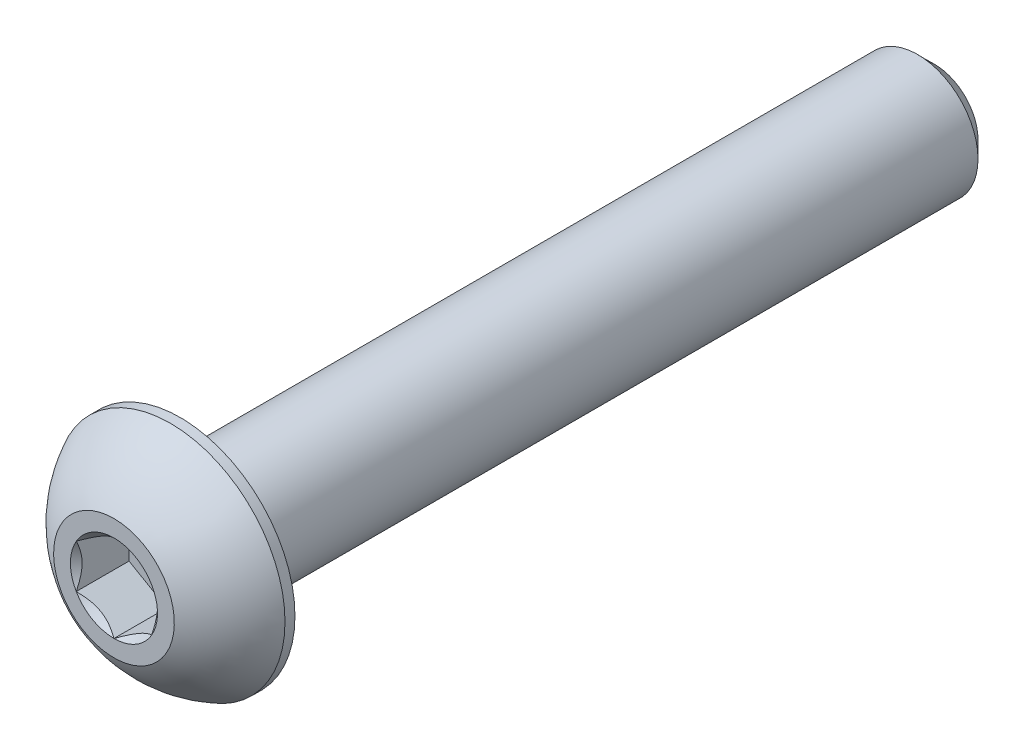
ISO-10303-21;
HEADER;
FILE_DESCRIPTION(('STEP AP214'),'2;1');
FILE_NAME('part.step','',(''),(''),'','','');
FILE_SCHEMA(('AUTOMOTIVE_DESIGN { 1 0 10303 214 1 1 1 1 }'));
ENDSEC;
DATA;
#1=APPLICATION_CONTEXT('core data for automotive mechanical design processes');
#2=APPLICATION_PROTOCOL_DEFINITION('international standard','automotive_design',2000,#1);
#3=PRODUCT_CONTEXT('',#1,'mechanical');
#4=PRODUCT('Part','Part','',(#3));
#5=PRODUCT_RELATED_PRODUCT_CATEGORY('part','',(#4));
#6=PRODUCT_DEFINITION_FORMATION('','',#4);
#7=PRODUCT_DEFINITION_CONTEXT('part definition',#1,'design');
#8=PRODUCT_DEFINITION('design','',#6,#7);
#9=PRODUCT_DEFINITION_SHAPE('','',#8);
#10=(LENGTH_UNIT() NAMED_UNIT(*) SI_UNIT(.MILLI.,.METRE.));
#11=(NAMED_UNIT(*) PLANE_ANGLE_UNIT() SI_UNIT($,.RADIAN.));
#12=(NAMED_UNIT(*) SI_UNIT($,.STERADIAN.) SOLID_ANGLE_UNIT());
#13=UNCERTAINTY_MEASURE_WITH_UNIT(LENGTH_MEASURE(1.E-05),#10,'distance_accuracy_value','');
#14=(GEOMETRIC_REPRESENTATION_CONTEXT(3) GLOBAL_UNCERTAINTY_ASSIGNED_CONTEXT((#13)) GLOBAL_UNIT_ASSIGNED_CONTEXT((#10,
#11,#12)) REPRESENTATION_CONTEXT('',''));
#15=CARTESIAN_POINT('',(0.,0.,0.));
#16=DIRECTION('',(0.,0.,1.));
#17=DIRECTION('',(1.,0.,0.));
#18=AXIS2_PLACEMENT_3D('',#15,#16,#17);
#19=CARTESIAN_POINT('',(0.,0.,13.6));
#20=DIRECTION('',(0.,0.,-1.));
#21=DIRECTION('',(-1.,0.,0.));
#22=AXIS2_PLACEMENT_3D('',#19,#20,#21);
#23=PLANE('',#22);
#24=CARTESIAN_POINT('',(0.,0.,13.6));
#25=DIRECTION('',(0.,0.,1.));
#26=DIRECTION('',(1.,0.,0.));
#27=AXIS2_PLACEMENT_3D('',#24,#25,#26);
#28=CIRCLE('',#27,1.44337567297406);
#29=CARTESIAN_POINT('',(-1.25,0.721687836487033,13.6));
#30=VERTEX_POINT('',#29);
#31=CARTESIAN_POINT('',(-1.25,-0.721687836487033,13.6));
#32=VERTEX_POINT('',#31);
#33=EDGE_CURVE('E130',#30,#32,#28,.T.);
#34=ORIENTED_EDGE('',*,*,#33,.F.);
#35=CARTESIAN_POINT('',(0.,1.44337567297406,13.6));
#36=VERTEX_POINT('',#35);
#37=EDGE_CURVE('E102',#36,#30,#28,.T.);
#38=ORIENTED_EDGE('',*,*,#37,.F.);
#39=CARTESIAN_POINT('',(1.25,0.721687836487032,13.6));
#40=VERTEX_POINT('',#39);
#41=EDGE_CURVE('E93',#40,#36,#28,.T.);
#42=ORIENTED_EDGE('',*,*,#41,.F.);
#43=CARTESIAN_POINT('',(1.25,-0.721687836487032,13.6));
#44=VERTEX_POINT('',#43);
#45=EDGE_CURVE('E54',#44,#40,#28,.T.);
#46=ORIENTED_EDGE('',*,*,#45,.F.);
#47=CARTESIAN_POINT('',(0.,-1.44337567297406,13.6));
#48=VERTEX_POINT('',#47);
#49=EDGE_CURVE('E61',#48,#44,#28,.T.);
#50=ORIENTED_EDGE('',*,*,#49,.F.);
#51=EDGE_CURVE('E131',#32,#48,#28,.T.);
#52=ORIENTED_EDGE('',*,*,#51,.F.);
#53=EDGE_LOOP('',(#34,#38,#42,#46,#50,#52));
#54=FACE_BOUND('',#53,.T.);
#55=CARTESIAN_POINT('',(0.,0.,13.6));
#56=DIRECTION('',(0.,0.,1.));
#57=DIRECTION('',(1.,0.,0.));
#58=AXIS2_PLACEMENT_3D('',#55,#56,#57);
#59=CIRCLE('',#58,2.);
#60=CARTESIAN_POINT('',(0.,2.,13.6));
#61=VERTEX_POINT('',#60);
#62=EDGE_CURVE('E48',#61,#61,#59,.T.);
#63=ORIENTED_EDGE('',*,*,#62,.T.);
#64=EDGE_LOOP('',(#63));
#65=FACE_BOUND('',#64,.T.);
#66=ADVANCED_FACE('F35',(#54,#65),#23,.F.);
#67=CARTESIAN_POINT('',(0.,0.,9.87355614973262));
#68=DIRECTION('',(0.,0.,1.));
#69=DIRECTION('',(0.,1.,0.));
#70=AXIS2_PLACEMENT_3D('',#67,#68,#69);
#71=SPHERICAL_SURFACE('',#70,4.22922968981298);
#72=CARTESIAN_POINT('',(0.,0.,11.73));
#73=DIRECTION('',(0.,0.,1.));
#74=DIRECTION('',(1.,0.,0.));
#75=AXIS2_PLACEMENT_3D('',#72,#73,#74);
#76=CIRCLE('',#75,3.8);
#77=CARTESIAN_POINT('',(0.,3.8,11.73));
#78=VERTEX_POINT('',#77);
#79=EDGE_CURVE('E213',#78,#78,#76,.T.);
#80=CARTESIAN_POINT('',(0.,2.,13.6));
#81=CARTESIAN_POINT('',(0.,2.02421343985614,13.5870045740355));
#82=CARTESIAN_POINT('',(0.,2.04830018323974,13.5737730870349));
#83=CARTESIAN_POINT('',(0.,2.09621120342126,13.5468431584943));
#84=CARTESIAN_POINT('',(0.,2.12003548021917,13.5331447169543));
#85=CARTESIAN_POINT('',(0.,2.16741249358867,13.505286046868));
#86=CARTESIAN_POINT('',(0.,2.19096523016026,13.4911258183216));
#87=CARTESIAN_POINT('',(0.,2.23779021933682,13.462348964764));
#88=CARTESIAN_POINT('',(0.,2.26106247194181,13.4477323397528));
#89=CARTESIAN_POINT('',(0.,2.30731764886072,13.4180482444859));
#90=CARTESIAN_POINT('',(0.,2.33030057317465,13.4029807742302));
#91=CARTESIAN_POINT('',(0.,2.37596836104235,13.3724007144171));
#92=CARTESIAN_POINT('',(0.,2.39865322459612,13.3568881248597));
#93=CARTESIAN_POINT('',(0.,2.44371627121513,13.3254237206041));
#94=CARTESIAN_POINT('',(0.,2.46609445428038,13.3094719059059));
#95=CARTESIAN_POINT('',(0.,2.51053563686181,13.2771351126683));
#96=CARTESIAN_POINT('',(0.,2.53259863637801,13.2607501341289));
#97=CARTESIAN_POINT('',(0.,2.57640106852492,13.2275532390328));
#98=CARTESIAN_POINT('',(0.,2.59814050115564,13.2107413224761));
#99=CARTESIAN_POINT('',(0.,2.64128753915153,13.1766969394119));
#100=CARTESIAN_POINT('',(0.,2.66269514451671,13.1594644729043));
#101=CARTESIAN_POINT('',(0.,2.70517039368395,13.124585537797));
#102=CARTESIAN_POINT('',(0.,2.72623803748602,13.1069390691974));
#103=CARTESIAN_POINT('',(0.,2.76802535840618,13.0712388350756));
#104=CARTESIAN_POINT('',(0.,2.78874503552428,13.0531850695534));
#105=CARTESIAN_POINT('',(0.,2.82982855017313,13.0166771015172));
#106=CARTESIAN_POINT('',(0.,2.85019238770389,12.9982228990032));
#107=CARTESIAN_POINT('',(0.,2.89055648548394,12.960921069069));
#108=CARTESIAN_POINT('',(0.,2.91055674573324,12.9420734416488));
#109=CARTESIAN_POINT('',(0.,2.95018608940553,12.9039919234787));
#110=CARTESIAN_POINT('',(0.,2.96981517282852,12.8847580327288));
#111=CARTESIAN_POINT('',(0.,3.00869470434027,12.8459112962447));
#112=CARTESIAN_POINT('',(0.,3.02794515242903,12.8262984505106));
#113=CARTESIAN_POINT('',(0.,3.06606009863533,12.7867012563963));
#114=CARTESIAN_POINT('',(0.,3.08492459675287,12.7667169080161));
#115=CARTESIAN_POINT('',(0.,3.12226047503002,12.7263843021083));
#116=CARTESIAN_POINT('',(0.,3.14073185518965,12.7060360445808));
#117=CARTESIAN_POINT('',(0.,3.17727447893821,12.6649833521526));
#118=CARTESIAN_POINT('',(0.,3.19534572252715,12.6442789172519));
#119=CARTESIAN_POINT('',(0.,3.23108120656242,12.602521737189));
#120=CARTESIAN_POINT('',(0.,3.24874544700875,12.5814689920269));
#121=CARTESIAN_POINT('',(0.,3.28366021283673,12.539023190901));
#122=CARTESIAN_POINT('',(0.,3.30091073821839,12.5176301349374));
#123=CARTESIAN_POINT('',(0.,3.33499151919534,12.4745118409772));
#124=CARTESIAN_POINT('',(0.,3.35182177479064,12.4527866029806));
#125=CARTESIAN_POINT('',(0.,3.38505562116371,12.4090121999432));
#126=CARTESIAN_POINT('',(0.,3.40145921194149,12.3869630349023));
#127=CARTESIAN_POINT('',(0.,3.43383349577047,12.3425491558485));
#128=CARTESIAN_POINT('',(0.,3.44980418882166,12.3201844418356));
#129=CARTESIAN_POINT('',(0.,3.48130660877275,12.2751479628077));
#130=CARTESIAN_POINT('',(0.,3.49683833567264,12.2524761977926));
#131=CARTESIAN_POINT('',(0.,3.52745692170931,12.2068342314103));
#132=CARTESIAN_POINT('',(0.,3.5425437808461,12.1838640300431));
#133=CARTESIAN_POINT('',(0.,3.57226689871518,12.1376339189693));
#134=CARTESIAN_POINT('',(0.,3.58690315744748,12.1143740092629));
#135=CARTESIAN_POINT('',(0.,3.61571951333199,12.0675733197334));
#136=CARTESIAN_POINT('',(0.,3.62989961048422,12.0440325399103));
#137=CARTESIAN_POINT('',(0.,3.65779825442823,11.9966790546141));
#138=CARTESIAN_POINT('',(0.,3.67151680122002,11.9728663491409));
#139=CARTESIAN_POINT('',(0.,3.69848713452322,11.9249780621223));
#140=CARTESIAN_POINT('',(0.,3.71173892103462,11.9009024805769));
#141=CARTESIAN_POINT('',(0.,3.73777068821038,11.8524975842079));
#142=CARTESIAN_POINT('',(0.,3.75055066887474,11.8281682693842));
#143=CARTESIAN_POINT('',(0.,3.77563400658954,11.7792651705548));
#144=CARTESIAN_POINT('',(0.,3.78793736363997,11.754691386549));
#145=CARTESIAN_POINT('',(0.,3.8,11.73));
#146=B_SPLINE_CURVE_WITH_KNOTS('',3,(#80,#81,#82,#83,#84,#85,#86,#87,#88,#89,#90,#91,#92,#93,
#94,#95,#96,#97,#98,#99,#100,#101,#102,#103,#104,#105,#106,#107,#108,#109,#110,#111,#112,#113,
#114,#115,#116,#117,#118,#119,#120,#121,#122,#123,#124,#125,#126,#127,#128,#129,#130,#131,#132,
#133,#134,#135,#136,#137,#138,#139,#140,#141,#142,#143,#144,#145),.UNSPECIFIED.,.F.,.F.,(4,2,2,
2,2,2,2,2,2,2,2,2,2,2,2,2,2,2,2,2,2,2,2,2,2,2,2,2,2,2,2,2,4),(0.,0.0824398589102646,
0.164879717820529,0.247319576730793,0.329759435641058,0.412199294551322,0.494639153461586,
0.577079012371851,0.659518871282115,0.74195873019238,0.824398589102644,0.906838448012908,
0.989278306923172,1.07171816583344,1.1541580247437,1.23659788365397,1.31903774256423,
1.40147760147449,1.48391746038476,1.56635731929502,1.64879717820529,1.73123703711555,
1.81367689602582,1.89611675493608,1.97855661384635,2.06099647275661,2.14343633166687,
2.22587619057714,2.3083160494874,2.39075590839767,2.47319576730793,2.55563562621819,
2.63807548512846),.UNSPECIFIED.);
#147=EDGE_CURVE('BSEAM218',#61,#78,#146,.T.);
#148=ORIENTED_EDGE('',*,*,#62,.F.);
#149=ORIENTED_EDGE('',*,*,#79,.T.);
#150=ORIENTED_EDGE('',*,*,#147,.T.);
#151=ORIENTED_EDGE('',*,*,#147,.F.);
#152=EDGE_LOOP('',(#148,#150,#149,#151));
#153=FACE_BOUND('',#152,.T.);
#154=ADVANCED_FACE('F218',(#153),#71,.T.);
#155=CARTESIAN_POINT('',(0.,0.,13.6));
#156=DIRECTION('',(0.,0.,1.));
#157=DIRECTION('',(1.,0.,0.));
#158=AXIS2_PLACEMENT_3D('',#155,#156,#157);
#159=CYLINDRICAL_SURFACE('',#158,3.8);
#160=ORIENTED_EDGE('',*,*,#79,.F.);
#161=EDGE_LOOP('',(#160));
#162=FACE_BOUND('',#161,.T.);
#163=CARTESIAN_POINT('',(0.,0.,11.4));
#164=DIRECTION('',(0.,0.,1.));
#165=DIRECTION('',(1.,0.,0.));
#166=AXIS2_PLACEMENT_3D('',#163,#164,#165);
#167=CIRCLE('',#166,3.8);
#168=CARTESIAN_POINT('',(3.8,0.,11.4));
#169=VERTEX_POINT('',#168);
#170=EDGE_CURVE('E210',#169,#169,#167,.T.);
#171=ORIENTED_EDGE('',*,*,#170,.T.);
#172=EDGE_LOOP('',(#171));
#173=FACE_BOUND('',#172,.T.);
#174=ADVANCED_FACE('F221',(#162,#173),#159,.T.);
#175=CARTESIAN_POINT('',(0.,1.99999999999999,11.4));
#176=DIRECTION('',(0.,0.,1.));
#177=DIRECTION('',(1.,0.,0.));
#178=AXIS2_PLACEMENT_3D('',#175,#176,#177);
#179=PLANE('',#178);
#180=ORIENTED_EDGE('',*,*,#170,.F.);
#181=EDGE_LOOP('',(#180));
#182=FACE_BOUND('',#181,.T.);
#183=CARTESIAN_POINT('',(0.,0.,11.4));
#184=DIRECTION('',(0.,0.,1.));
#185=DIRECTION('',(1.,0.,0.));
#186=AXIS2_PLACEMENT_3D('',#183,#184,#185);
#187=CIRCLE('',#186,1.99999999999999);
#188=CARTESIAN_POINT('',(1.99999999999999,0.,11.4));
#189=VERTEX_POINT('',#188);
#190=EDGE_CURVE('E207',#189,#189,#187,.T.);
#191=ORIENTED_EDGE('',*,*,#190,.T.);
#192=EDGE_LOOP('',(#191));
#193=FACE_BOUND('',#192,.T.);
#194=ADVANCED_FACE('F226',(#182,#193),#179,.F.);
#195=CARTESIAN_POINT('',(0.,0.,13.6));
#196=DIRECTION('',(0.,0.,1.));
#197=DIRECTION('',(1.,0.,0.));
#198=AXIS2_PLACEMENT_3D('',#195,#196,#197);
#199=CYLINDRICAL_SURFACE('',#198,1.99999999999999);
#200=ORIENTED_EDGE('',*,*,#190,.F.);
#201=EDGE_LOOP('',(#200));
#202=FACE_BOUND('',#201,.T.);
#203=CARTESIAN_POINT('',(0.,0.,-13.04));
#204=DIRECTION('',(0.,0.,1.));
#205=DIRECTION('',(1.,0.,0.));
#206=AXIS2_PLACEMENT_3D('',#203,#204,#205);
#207=CIRCLE('',#206,1.99999999999999);
#208=CARTESIAN_POINT('',(1.99999999999999,0.,-13.04));
#209=VERTEX_POINT('',#208);
#210=EDGE_CURVE('E204',#209,#209,#207,.T.);
#211=ORIENTED_EDGE('',*,*,#210,.T.);
#212=EDGE_LOOP('',(#211));
#213=FACE_BOUND('',#212,.T.);
#214=ADVANCED_FACE('F232',(#202,#213),#199,.T.);
#215=CARTESIAN_POINT('',(0.,0.,-13.6));
#216=DIRECTION('',(0.,0.,1.));
#217=DIRECTION('',(1.,0.,0.));
#218=AXIS2_PLACEMENT_3D('',#215,#216,#217);
#219=CONICAL_SURFACE('',#218,1.44,0.785398163397446);
#220=ORIENTED_EDGE('',*,*,#210,.F.);
#221=EDGE_LOOP('',(#220));
#222=FACE_BOUND('',#221,.T.);
#223=CARTESIAN_POINT('',(0.,0.,-13.6));
#224=DIRECTION('',(0.,0.,1.));
#225=DIRECTION('',(1.,0.,0.));
#226=AXIS2_PLACEMENT_3D('',#223,#224,#225);
#227=CIRCLE('',#226,1.44);
#228=CARTESIAN_POINT('',(1.44,0.,-13.6));
#229=VERTEX_POINT('',#228);
#230=EDGE_CURVE('E191',#229,#229,#227,.T.);
#231=ORIENTED_EDGE('',*,*,#230,.T.);
#232=EDGE_LOOP('',(#231));
#233=FACE_BOUND('',#232,.T.);
#234=ADVANCED_FACE('F238',(#222,#233),#219,.T.);
#235=CARTESIAN_POINT('',(0.,0.,-13.6));
#236=DIRECTION('',(0.,0.,1.));
#237=DIRECTION('',(1.,0.,0.));
#238=AXIS2_PLACEMENT_3D('',#235,#236,#237);
#239=PLANE('',#238);
#240=ORIENTED_EDGE('',*,*,#230,.F.);
#241=EDGE_LOOP('',(#240));
#242=FACE_BOUND('',#241,.T.);
#243=ADVANCED_FACE('F164',(#242),#239,.F.);
#244=CARTESIAN_POINT('',(0.,0.,13.6));
#245=DIRECTION('',(0.,0.,1.));
#246=DIRECTION('',(1.,0.,0.));
#247=AXIS2_PLACEMENT_3D('',#244,#245,#246);
#248=CONICAL_SURFACE('',#247,1.44337567297406,0.78539816339745);
#249=ORIENTED_EDGE('',*,*,#37,.T.);
#250=CARTESIAN_POINT('',(0.000199999999999687,1.4434911430279,13.6001154839091));
#251=CARTESIAN_POINT('',(-0.0427751670715871,1.41867941875065,13.5753216680551));
#252=CARTESIAN_POINT('',(-0.0864690047459485,1.39345276980743,13.5519837344187));
#253=CARTESIAN_POINT('',(-0.175565930841942,1.34201263554194,13.5092520040845));
#254=CARTESIAN_POINT('',(-0.220977498357064,1.31579425481276,13.4898819923604));
#255=CARTESIAN_POINT('',(-0.31254782093526,1.26292610442246,13.4567004834135));
#256=CARTESIAN_POINT('',(-0.358683240175886,1.23628980770471,13.4428055590527));
#257=CARTESIAN_POINT('',(-0.451970080407593,1.18243062538508,13.4213972821606));
#258=CARTESIAN_POINT('',(-0.49911864913638,1.15520938653761,13.4138679415668));
#259=CARTESIAN_POINT('',(-0.580373556887252,1.10829684367467,13.4070744980507));
#260=CARTESIAN_POINT('',(-0.614374876627941,1.08866617256958,13.4060685591043));
#261=CARTESIAN_POINT('',(-0.682317764432477,1.04943932800611,13.4077614149113));
#262=CARTESIAN_POINT('',(-0.716259317655657,1.02984316311599,13.4104610272155));
#263=CARTESIAN_POINT('',(-0.783814856457499,0.9908399546035,13.4194089303164));
#264=CARTESIAN_POINT('',(-0.817428507286775,0.971433104248771,13.4256605258997));
#265=CARTESIAN_POINT('',(-0.884094638217813,0.932943395609906,13.4413756814139));
#266=CARTESIAN_POINT('',(-0.917146871030295,0.913860680098301,13.4508406200875));
#267=CARTESIAN_POINT('',(-1.00179969160026,0.864986351354568,13.4789313906876));
#268=CARTESIAN_POINT('',(-1.05286649242964,0.835502920149076,13.4996701574522));
#269=CARTESIAN_POINT('',(-1.15300085411325,0.777690319475909,13.5463871346715));
#270=CARTESIAN_POINT('',(-1.20207431157827,0.749357745598417,13.5723482959468));
#271=CARTESIAN_POINT('',(-1.2502,0.721572366433195,13.6001154839091));
#272=B_SPLINE_CURVE_WITH_KNOTS('',3,(#250,#251,#252,#253,#254,#255,#256,#257,#258,#259,#260,
#261,#262,#263,#264,#265,#266,#267,#268,#269,#270,#271),.UNSPECIFIED.,.F.,.F.,(4,2,2,2,2,2,2,2,
2,2,4),(0.,0.166533409618304,0.334037607289761,0.498880396489697,0.663307919240274,
0.780963963458826,0.898645970148452,1.01643764860773,1.13427993171549,1.32148652032141,
1.50809158792573),.UNSPECIFIED.);
#273=EDGE_CURVE('E11',#36,#30,#272,.T.);
#274=ORIENTED_EDGE('',*,*,#273,.F.);
#275=EDGE_LOOP('',(#249,#274));
#276=FACE_BOUND('',#275,.T.);
#277=ADVANCED_FACE('F106',(#276),#248,.F.);
#278=ORIENTED_EDGE('',*,*,#33,.T.);
#279=CARTESIAN_POINT('',(-1.25,-1.43934010808077,14.0629820968923));
#280=CARTESIAN_POINT('',(-1.25,-1.40429313005659,14.0365249226329));
#281=CARTESIAN_POINT('',(-1.25,-1.36905087135599,14.0103271603543));
#282=CARTESIAN_POINT('',(-1.25,-1.29809650706311,13.9585575718396));
#283=CARTESIAN_POINT('',(-1.25,-1.26238428576495,13.9329859043563));
#284=CARTESIAN_POINT('',(-1.25,-1.15390111792708,13.8570059936895));
#285=CARTESIAN_POINT('',(-1.25,-1.08031646726264,13.8077402861896));
#286=CARTESIAN_POINT('',(-1.25,-0.926012322755095,13.7110258302631));
#287=CARTESIAN_POINT('',(-1.25,-0.845125318656146,13.6638412989418));
#288=CARTESIAN_POINT('',(-1.25,-0.679311174076602,13.5775307343904));
#289=CARTESIAN_POINT('',(-1.25,-0.594398891026688,13.5383775346269));
#290=CARTESIAN_POINT('',(-1.25,-0.46694481246074,13.4904772236883));
#291=CARTESIAN_POINT('',(-1.25,-0.426289985812821,13.4767294897863));
#292=CARTESIAN_POINT('',(-1.25,-0.343998850091267,13.4524979274505));
#293=CARTESIAN_POINT('',(-1.25,-0.302362473614962,13.4420143238698));
#294=CARTESIAN_POINT('',(-1.25,-0.219052696285666,13.4250301617483));
#295=CARTESIAN_POINT('',(-1.25,-0.1773934284745,13.4184613604714));
#296=CARTESIAN_POINT('',(-1.25,-0.0936293693401925,13.4094350534578));
#297=CARTESIAN_POINT('',(-1.25,-0.0515246558543965,13.4069768409973));
#298=CARTESIAN_POINT('',(-1.25,0.0311890576306309,13.4063540620133));
#299=CARTESIAN_POINT('',(-1.25,0.0717969625499298,13.4080371168462));
#300=CARTESIAN_POINT('',(-1.25,0.152668636885196,13.4152682705979));
#301=CARTESIAN_POINT('',(-1.25,0.192932338835357,13.4208171104131));
#302=CARTESIAN_POINT('',(-1.25,0.273499879165294,13.435571036465));
#303=CARTESIAN_POINT('',(-1.25,0.31379218061851,13.4448381759641));
#304=CARTESIAN_POINT('',(-1.25,0.393496413911456,13.4665361784573));
#305=CARTESIAN_POINT('',(-1.25,0.432908419115058,13.4789667767306));
#306=CARTESIAN_POINT('',(-1.25,0.556992735862297,13.5227793529314));
#307=CARTESIAN_POINT('',(-1.25,0.639898924666084,13.559151072876));
#308=CARTESIAN_POINT('',(-1.25,0.8018165554997,13.6400191621783));
#309=CARTESIAN_POINT('',(-1.25,0.880812666325043,13.684544720912));
#310=CARTESIAN_POINT('',(-1.25,1.0317856127975,13.7764048766666));
#311=CARTESIAN_POINT('',(-1.25,1.10391618485086,13.8234899339162));
#312=CARTESIAN_POINT('',(-1.25,1.2101860604331,13.8962785615985));
#313=CARTESIAN_POINT('',(-1.25,1.24515069969379,13.9207980853934));
#314=CARTESIAN_POINT('',(-1.25,1.31460220852736,13.9704856367657));
#315=CARTESIAN_POINT('',(-1.25,1.34908920596618,13.9956534854155));
#316=CARTESIAN_POINT('',(-1.25,1.38337731682911,14.0210901488412));
#317=B_SPLINE_CURVE_WITH_KNOTS('',3,(#279,#280,#281,#282,#283,#284,#285,#286,#287,#288,#289,
#290,#291,#292,#293,#294,#295,#296,#297,#298,#299,#300,#301,#302,#303,#304,#305,#306,#307,#308,
#309,#310,#311,#312,#313,#314,#315,#316),.UNSPECIFIED.,.F.,.F.,(4,2,2,2,2,2,2,2,2,2,2,2,2,2,2,2,
2,2,4),(0.,0.131732960381448,0.263498984161645,0.529042014455826,0.80974192613462,
1.08947609717225,1.21811634272577,1.346765447839,1.47310084517844,1.59941451973784,
1.72115042167849,1.84290966131735,1.96679153905342,2.09066305366039,2.36146692896009,
2.63325989198491,2.89154668212279,3.01965734507713,3.14773302245628),.UNSPECIFIED.);
#318=EDGE_CURVE('E101',#30,#32,#317,.F.);
#319=ORIENTED_EDGE('',*,*,#318,.F.);
#320=EDGE_LOOP('',(#278,#319));
#321=FACE_BOUND('',#320,.T.);
#322=ADVANCED_FACE('F251',(#321),#248,.F.);
#323=ORIENTED_EDGE('',*,*,#51,.T.);
#324=CARTESIAN_POINT('',(-1.2502,-0.721572366433194,13.6001154839091));
#325=CARTESIAN_POINT('',(-1.20722483292841,-0.746384090710444,13.5753216680551));
#326=CARTESIAN_POINT('',(-1.16353099525405,-0.771610739653665,13.5519837344187));
#327=CARTESIAN_POINT('',(-1.07443406915806,-0.823050873919155,13.5092520040845));
#328=CARTESIAN_POINT('',(-1.02902250164294,-0.849269254648334,13.4898819923604));
#329=CARTESIAN_POINT('',(-0.937452179064739,-0.902137405038636,13.4567004834135));
#330=CARTESIAN_POINT('',(-0.891316759824113,-0.928773701756388,13.4428055590527));
#331=CARTESIAN_POINT('',(-0.798029919592406,-0.982632884076013,13.4213972821606));
#332=CARTESIAN_POINT('',(-0.750881350863619,-1.00985412292348,13.4138679415668));
#333=CARTESIAN_POINT('',(-0.669626443112747,-1.05676666578643,13.4070744980507));
#334=CARTESIAN_POINT('',(-0.635625123372058,-1.07639733689152,13.4060685591043));
#335=CARTESIAN_POINT('',(-0.567682235567522,-1.11562418145499,13.4077614149113));
#336=CARTESIAN_POINT('',(-0.533740682344342,-1.1352203463451,13.4104610272155));
#337=CARTESIAN_POINT('',(-0.4661851435425,-1.1742235548576,13.4194089303164));
#338=CARTESIAN_POINT('',(-0.432571492713225,-1.19363040521233,13.4256605258997));
#339=CARTESIAN_POINT('',(-0.365905361782186,-1.23212011385119,13.4413756814139));
#340=CARTESIAN_POINT('',(-0.332853128969704,-1.2512028293628,13.4508406200875));
#341=CARTESIAN_POINT('',(-0.248200308399735,-1.30007715810653,13.4789313906876));
#342=CARTESIAN_POINT('',(-0.197133507570362,-1.32956058931202,13.4996701574522));
#343=CARTESIAN_POINT('',(-0.0969991458867455,-1.38737318998519,13.5463871346715));
#344=CARTESIAN_POINT('',(-0.047925688421731,-1.41570576386268,13.5723482959468));
#345=CARTESIAN_POINT('',(0.000199999999999445,-1.4434911430279,13.6001154839091));
#346=B_SPLINE_CURVE_WITH_KNOTS('',3,(#324,#325,#326,#327,#328,#329,#330,#331,#332,#333,#334,
#335,#336,#337,#338,#339,#340,#341,#342,#343,#344,#345),.UNSPECIFIED.,.F.,.F.,(4,2,2,2,2,2,2,2,
2,2,4),(0.,0.166533409618305,0.334037607289762,0.498880396489699,0.663307919240275,
0.780963963458827,0.898645970148453,1.01643764860773,1.1342799317155,1.32148652032141,
1.50809158792573),.UNSPECIFIED.);
#347=EDGE_CURVE('E140',#32,#48,#346,.T.);
#348=ORIENTED_EDGE('',*,*,#347,.F.);
#349=EDGE_LOOP('',(#323,#348));
#350=FACE_BOUND('',#349,.T.);
#351=ADVANCED_FACE('F268',(#350),#248,.F.);
#352=ORIENTED_EDGE('',*,*,#49,.T.);
#353=CARTESIAN_POINT('',(-0.000200000000000272,-1.4434911430279,13.6001154839091));
#354=CARTESIAN_POINT('',(0.0427751670715867,-1.41867941875065,13.5753216680551));
#355=CARTESIAN_POINT('',(0.0864690047459484,-1.39345276980743,13.5519837344187));
#356=CARTESIAN_POINT('',(0.175565930841943,-1.34201263554194,13.5092520040845));
#357=CARTESIAN_POINT('',(0.220977498357065,-1.31579425481276,13.4898819923604));
#358=CARTESIAN_POINT('',(0.31254782093526,-1.26292610442246,13.4567004834135));
#359=CARTESIAN_POINT('',(0.358683240175886,-1.23628980770471,13.4428055590527));
#360=CARTESIAN_POINT('',(0.451970080407593,-1.18243062538508,13.4213972821606));
#361=CARTESIAN_POINT('',(0.499118649136381,-1.15520938653761,13.4138679415668));
#362=CARTESIAN_POINT('',(0.580373556887253,-1.10829684367467,13.4070744980507));
#363=CARTESIAN_POINT('',(0.614374876627942,-1.08866617256958,13.4060685591043));
#364=CARTESIAN_POINT('',(0.682317764432478,-1.04943932800611,13.4077614149113));
#365=CARTESIAN_POINT('',(0.716259317655658,-1.02984316311599,13.4104610272155));
#366=CARTESIAN_POINT('',(0.7838148564575,-0.990839954603498,13.4194089303164));
#367=CARTESIAN_POINT('',(0.817428507286776,-0.97143310424877,13.4256605258997));
#368=CARTESIAN_POINT('',(0.884094638217814,-0.932943395609904,13.4413756814139));
#369=CARTESIAN_POINT('',(0.917146871030297,-0.9138606800983,13.4508406200875));
#370=CARTESIAN_POINT('',(1.00179969160027,-0.864986351354567,13.4789313906876));
#371=CARTESIAN_POINT('',(1.05286649242964,-0.835502920149075,13.4996701574522));
#372=CARTESIAN_POINT('',(1.15300085411325,-0.777690319475908,13.5463871346715));
#373=CARTESIAN_POINT('',(1.20207431157827,-0.749357745598417,13.5723482959468));
#374=CARTESIAN_POINT('',(1.2502,-0.721572366433194,13.6001154839091));
#375=B_SPLINE_CURVE_WITH_KNOTS('',3,(#353,#354,#355,#356,#357,#358,#359,#360,#361,#362,#363,
#364,#365,#366,#367,#368,#369,#370,#371,#372,#373,#374),.UNSPECIFIED.,.F.,.F.,(4,2,2,2,2,2,2,2,
2,2,4),(0.,0.166533409618305,0.334037607289762,0.498880396489699,0.663307919240275,
0.780963963458828,0.898645970148454,1.01643764860773,1.1342799317155,1.32148652032141,
1.50809158792574),.UNSPECIFIED.);
#376=EDGE_CURVE('E348',#48,#44,#375,.T.);
#377=ORIENTED_EDGE('',*,*,#376,.F.);
#378=EDGE_LOOP('',(#352,#377));
#379=FACE_BOUND('',#378,.T.);
#380=ADVANCED_FACE('F275',(#379),#248,.F.);
#381=ORIENTED_EDGE('',*,*,#45,.T.);
#382=CARTESIAN_POINT('',(1.25,-1.43934010808077,14.0629820968923));
#383=CARTESIAN_POINT('',(1.25,-1.40429313005659,14.0365249226329));
#384=CARTESIAN_POINT('',(1.25,-1.36905087135599,14.0103271603543));
#385=CARTESIAN_POINT('',(1.25,-1.29809650706311,13.9585575718396));
#386=CARTESIAN_POINT('',(1.25,-1.26238428576495,13.9329859043563));
#387=CARTESIAN_POINT('',(1.25,-1.15390111792708,13.8570059936895));
#388=CARTESIAN_POINT('',(1.25,-1.08031646726264,13.8077402861896));
#389=CARTESIAN_POINT('',(1.25,-0.926012322755094,13.7110258302631));
#390=CARTESIAN_POINT('',(1.25,-0.845125318656145,13.6638412989418));
#391=CARTESIAN_POINT('',(1.25,-0.679311174076601,13.5775307343904));
#392=CARTESIAN_POINT('',(1.25,-0.594398891026687,13.5383775346269));
#393=CARTESIAN_POINT('',(1.25,-0.466944812460739,13.4904772236883));
#394=CARTESIAN_POINT('',(1.25,-0.426289985812821,13.4767294897863));
#395=CARTESIAN_POINT('',(1.25,-0.343998850091267,13.4524979274505));
#396=CARTESIAN_POINT('',(1.25,-0.302362473614961,13.4420143238698));
#397=CARTESIAN_POINT('',(1.25,-0.219052696285665,13.4250301617483));
#398=CARTESIAN_POINT('',(1.25,-0.177393428474499,13.4184613604714));
#399=CARTESIAN_POINT('',(1.25,-0.0936293693401918,13.4094350534578));
#400=CARTESIAN_POINT('',(1.25,-0.0515246558543957,13.4069768409973));
#401=CARTESIAN_POINT('',(1.25,0.0311890576306319,13.4063540620133));
#402=CARTESIAN_POINT('',(1.25,0.0717969625499307,13.4080371168462));
#403=CARTESIAN_POINT('',(1.25,0.152668636885197,13.4152682705979));
#404=CARTESIAN_POINT('',(1.25,0.192932338835358,13.4208171104131));
#405=CARTESIAN_POINT('',(1.25,0.273499879165295,13.435571036465));
#406=CARTESIAN_POINT('',(1.25,0.313792180618512,13.4448381759641));
#407=CARTESIAN_POINT('',(1.25,0.393496413911458,13.4665361784573));
#408=CARTESIAN_POINT('',(1.25,0.432908419115059,13.4789667767306));
#409=CARTESIAN_POINT('',(1.25,0.556992735862298,13.5227793529314));
#410=CARTESIAN_POINT('',(1.25,0.639898924666086,13.559151072876));
#411=CARTESIAN_POINT('',(1.25,0.801816555499702,13.6400191621783));
#412=CARTESIAN_POINT('',(1.25,0.880812666325045,13.684544720912));
#413=CARTESIAN_POINT('',(1.25,1.0317856127975,13.7764048766666));
#414=CARTESIAN_POINT('',(1.25,1.10391618485086,13.8234899339162));
#415=CARTESIAN_POINT('',(1.25,1.2101860604331,13.8962785615985));
#416=CARTESIAN_POINT('',(1.25,1.24515069969379,13.9207980853934));
#417=CARTESIAN_POINT('',(1.25,1.31460220852736,13.9704856367657));
#418=CARTESIAN_POINT('',(1.25,1.34908920596618,13.9956534854155));
#419=CARTESIAN_POINT('',(1.25,1.38337731682912,14.0210901488412));
#420=B_SPLINE_CURVE_WITH_KNOTS('',3,(#382,#383,#384,#385,#386,#387,#388,#389,#390,#391,#392,
#393,#394,#395,#396,#397,#398,#399,#400,#401,#402,#403,#404,#405,#406,#407,#408,#409,#410,#411,
#412,#413,#414,#415,#416,#417,#418,#419),.UNSPECIFIED.,.F.,.F.,(4,2,2,2,2,2,2,2,2,2,2,2,2,2,2,2,
2,2,4),(0.,0.131732960381448,0.263498984161644,0.529042014455826,0.80974192613462,
1.08947609717225,1.21811634272577,1.346765447839,1.47310084517844,1.59941451973784,
1.72115042167849,1.84290966131735,1.96679153905342,2.09066305366039,2.36146692896009,
2.63325989198491,2.89154668212279,3.01965734507713,3.14773302245628),.UNSPECIFIED.);
#421=EDGE_CURVE('E118',#44,#40,#420,.T.);
#422=ORIENTED_EDGE('',*,*,#421,.F.);
#423=EDGE_LOOP('',(#381,#422));
#424=FACE_BOUND('',#423,.T.);
#425=ADVANCED_FACE('F282',(#424),#248,.F.);
#426=ORIENTED_EDGE('',*,*,#41,.T.);
#427=CARTESIAN_POINT('',(1.2502,0.721572366433194,13.6001154839091));
#428=CARTESIAN_POINT('',(1.20722483292841,0.746384090710444,13.5753216680551));
#429=CARTESIAN_POINT('',(1.16353099525405,0.771610739653665,13.5519837344187));
#430=CARTESIAN_POINT('',(1.07443406915806,0.823050873919156,13.5092520040845));
#431=CARTESIAN_POINT('',(1.02902250164293,0.849269254648334,13.4898819923604));
#432=CARTESIAN_POINT('',(0.937452179064739,0.902137405038636,13.4567004834135));
#433=CARTESIAN_POINT('',(0.891316759824113,0.928773701756388,13.4428055590527));
#434=CARTESIAN_POINT('',(0.798029919592406,0.982632884076013,13.4213972821606));
#435=CARTESIAN_POINT('',(0.750881350863619,1.00985412292348,13.4138679415668));
#436=CARTESIAN_POINT('',(0.669626443112746,1.05676666578643,13.4070744980507));
#437=CARTESIAN_POINT('',(0.635625123372058,1.07639733689152,13.4060685591043));
#438=CARTESIAN_POINT('',(0.567682235567521,1.11562418145499,13.4077614149113));
#439=CARTESIAN_POINT('',(0.533740682344341,1.1352203463451,13.4104610272155));
#440=CARTESIAN_POINT('',(0.466185143542499,1.1742235548576,13.4194089303164));
#441=CARTESIAN_POINT('',(0.432571492713224,1.19363040521233,13.4256605258997));
#442=CARTESIAN_POINT('',(0.365905361782186,1.23212011385119,13.4413756814139));
#443=CARTESIAN_POINT('',(0.332853128969703,1.2512028293628,13.4508406200875));
#444=CARTESIAN_POINT('',(0.248200308399734,1.30007715810653,13.4789313906876));
#445=CARTESIAN_POINT('',(0.197133507570361,1.32956058931202,13.4996701574522));
#446=CARTESIAN_POINT('',(0.0969991458867447,1.38737318998519,13.5463871346715));
#447=CARTESIAN_POINT('',(0.0479256884217304,1.41570576386268,13.5723482959468));
#448=CARTESIAN_POINT('',(-0.00019999999999985,1.4434911430279,13.6001154839091));
#449=B_SPLINE_CURVE_WITH_KNOTS('',3,(#427,#428,#429,#430,#431,#432,#433,#434,#435,#436,#437,
#438,#439,#440,#441,#442,#443,#444,#445,#446,#447,#448),.UNSPECIFIED.,.F.,.F.,(4,2,2,2,2,2,2,2,
2,2,4),(0.,0.166533409618305,0.334037607289763,0.4988803964897,0.663307919240276,
0.780963963458828,0.898645970148454,1.01643764860773,1.1342799317155,1.32148652032141,
1.50809158792573),.UNSPECIFIED.);
#450=EDGE_CURVE('E97',#40,#36,#449,.T.);
#451=ORIENTED_EDGE('',*,*,#450,.F.);
#452=EDGE_LOOP('',(#426,#451));
#453=FACE_BOUND('',#452,.T.);
#454=ADVANCED_FACE('F95',(#453),#248,.F.);
#455=CARTESIAN_POINT('',(0.,0.,11.85));
#456=DIRECTION('',(0.,0.,1.));
#457=DIRECTION('',(1.,0.,0.));
#458=AXIS2_PLACEMENT_3D('',#455,#456,#457);
#459=PLANE('',#458);
#460=DIRECTION('',(-0.866025403784439,0.5,0.));
#461=VECTOR('',#460,1.);
#462=CARTESIAN_POINT('',(1.25,0.721687836487032,11.85));
#463=LINE('',#462,#461);
#464=CARTESIAN_POINT('',(1.25,0.721687836487032,11.85));
#465=VERTEX_POINT('',#464);
#466=CARTESIAN_POINT('',(0.,1.44337567297406,11.85));
#467=VERTEX_POINT('',#466);
#468=EDGE_CURVE('E117',#465,#467,#463,.T.);
#469=ORIENTED_EDGE('',*,*,#468,.T.);
#470=DIRECTION('',(-0.866025403784439,-0.5,0.));
#471=VECTOR('',#470,1.);
#472=CARTESIAN_POINT('',(0.,1.44337567297406,11.85));
#473=LINE('',#472,#471);
#474=CARTESIAN_POINT('',(-1.25,0.721687836487033,11.85));
#475=VERTEX_POINT('',#474);
#476=EDGE_CURVE('E122',#467,#475,#473,.T.);
#477=ORIENTED_EDGE('',*,*,#476,.T.);
#478=DIRECTION('',(0.,-1.,0.));
#479=VECTOR('',#478,1.);
#480=CARTESIAN_POINT('',(-1.25,0.721687836487033,11.85));
#481=LINE('',#480,#479);
#482=CARTESIAN_POINT('',(-1.25,-0.721687836487032,11.85));
#483=VERTEX_POINT('',#482);
#484=EDGE_CURVE('E179',#475,#483,#481,.T.);
#485=ORIENTED_EDGE('',*,*,#484,.T.);
#486=DIRECTION('',(0.866025403784439,-0.5,0.));
#487=VECTOR('',#486,1.);
#488=CARTESIAN_POINT('',(-1.25,-0.721687836487032,11.85));
#489=LINE('',#488,#487);
#490=CARTESIAN_POINT('',(0.,-1.44337567297406,11.85));
#491=VERTEX_POINT('',#490);
#492=EDGE_CURVE('E182',#483,#491,#489,.T.);
#493=ORIENTED_EDGE('',*,*,#492,.T.);
#494=DIRECTION('',(0.866025403784439,0.5,0.));
#495=VECTOR('',#494,1.);
#496=CARTESIAN_POINT('',(0.,-1.44337567297406,11.85));
#497=LINE('',#496,#495);
#498=CARTESIAN_POINT('',(1.25,-0.721687836487032,11.85));
#499=VERTEX_POINT('',#498);
#500=EDGE_CURVE('E185',#491,#499,#497,.T.);
#501=ORIENTED_EDGE('',*,*,#500,.T.);
#502=DIRECTION('',(0.,1.,0.));
#503=VECTOR('',#502,1.);
#504=CARTESIAN_POINT('',(1.25,-0.721687836487032,11.85));
#505=LINE('',#504,#503);
#506=EDGE_CURVE('E125',#499,#465,#505,.T.);
#507=ORIENTED_EDGE('',*,*,#506,.T.);
#508=EDGE_LOOP('',(#469,#477,#485,#493,#501,#507));
#509=FACE_BOUND('',#508,.T.);
#510=ADVANCED_FACE('F159',(#509),#459,.T.);
#511=CARTESIAN_POINT('',(0.,1.44337567297406,11.85));
#512=DIRECTION('',(-0.5,0.866025403784439,0.));
#513=DIRECTION('',(-0.866025403784439,-0.5,0.));
#514=AXIS2_PLACEMENT_3D('',#511,#512,#513);
#515=PLANE('',#514);
#516=DIRECTION('',(0.,0.,1.));
#517=VECTOR('',#516,1.);
#518=CARTESIAN_POINT('',(0.,1.44337567297406,11.85));
#519=LINE('',#518,#517);
#520=EDGE_CURVE('E114',#467,#36,#519,.T.);
#521=ORIENTED_EDGE('',*,*,#520,.T.);
#522=ORIENTED_EDGE('',*,*,#273,.T.);
#523=DIRECTION('',(0.,0.,1.));
#524=VECTOR('',#523,1.);
#525=CARTESIAN_POINT('',(-1.25,0.721687836487033,11.85));
#526=LINE('',#525,#524);
#527=EDGE_CURVE('E124',#475,#30,#526,.T.);
#528=ORIENTED_EDGE('',*,*,#527,.F.);
#529=ORIENTED_EDGE('',*,*,#476,.F.);
#530=EDGE_LOOP('',(#521,#522,#528,#529));
#531=FACE_BOUND('',#530,.T.);
#532=ADVANCED_FACE('F120',(#531),#515,.F.);
#533=CARTESIAN_POINT('',(-1.25,0.721687836487033,11.85));
#534=DIRECTION('',(-1.,0.,0.));
#535=DIRECTION('',(0.,0.,1.));
#536=AXIS2_PLACEMENT_3D('',#533,#534,#535);
#537=PLANE('',#536);
#538=ORIENTED_EDGE('',*,*,#527,.T.);
#539=ORIENTED_EDGE('',*,*,#318,.T.);
#540=DIRECTION('',(0.,0.,1.));
#541=VECTOR('',#540,1.);
#542=CARTESIAN_POINT('',(-1.25,-0.721687836487032,11.85));
#543=LINE('',#542,#541);
#544=EDGE_CURVE('E198',#483,#32,#543,.T.);
#545=ORIENTED_EDGE('',*,*,#544,.F.);
#546=ORIENTED_EDGE('',*,*,#484,.F.);
#547=EDGE_LOOP('',(#538,#539,#545,#546));
#548=FACE_BOUND('',#547,.T.);
#549=ADVANCED_FACE('F149',(#548),#537,.F.);
#550=CARTESIAN_POINT('',(-1.25,-0.721687836487032,11.85));
#551=DIRECTION('',(-0.5,-0.866025403784438,0.));
#552=DIRECTION('',(0.866025403784439,-0.5,0.));
#553=AXIS2_PLACEMENT_3D('',#550,#551,#552);
#554=PLANE('',#553);
#555=ORIENTED_EDGE('',*,*,#544,.T.);
#556=ORIENTED_EDGE('',*,*,#347,.T.);
#557=DIRECTION('',(0.,0.,1.));
#558=VECTOR('',#557,1.);
#559=CARTESIAN_POINT('',(0.,-1.44337567297406,11.85));
#560=LINE('',#559,#558);
#561=EDGE_CURVE('E195',#491,#48,#560,.T.);
#562=ORIENTED_EDGE('',*,*,#561,.F.);
#563=ORIENTED_EDGE('',*,*,#492,.F.);
#564=EDGE_LOOP('',(#555,#556,#562,#563));
#565=FACE_BOUND('',#564,.T.);
#566=ADVANCED_FACE('F152',(#565),#554,.F.);
#567=CARTESIAN_POINT('',(0.,-1.44337567297406,11.85));
#568=DIRECTION('',(0.5,-0.866025403784439,0.));
#569=DIRECTION('',(0.866025403784439,0.5,0.));
#570=AXIS2_PLACEMENT_3D('',#567,#568,#569);
#571=PLANE('',#570);
#572=ORIENTED_EDGE('',*,*,#561,.T.);
#573=ORIENTED_EDGE('',*,*,#376,.T.);
#574=DIRECTION('',(0.,0.,1.));
#575=VECTOR('',#574,1.);
#576=CARTESIAN_POINT('',(1.25,-0.721687836487032,11.85));
#577=LINE('',#576,#575);
#578=EDGE_CURVE('E192',#499,#44,#577,.T.);
#579=ORIENTED_EDGE('',*,*,#578,.F.);
#580=ORIENTED_EDGE('',*,*,#500,.F.);
#581=EDGE_LOOP('',(#572,#573,#579,#580));
#582=FACE_BOUND('',#581,.T.);
#583=ADVANCED_FACE('F306',(#582),#571,.F.);
#584=CARTESIAN_POINT('',(1.25,-0.721687836487032,11.85));
#585=DIRECTION('',(1.,0.,0.));
#586=DIRECTION('',(0.,1.,0.));
#587=AXIS2_PLACEMENT_3D('',#584,#585,#586);
#588=PLANE('',#587);
#589=ORIENTED_EDGE('',*,*,#578,.T.);
#590=ORIENTED_EDGE('',*,*,#421,.T.);
#591=DIRECTION('',(0.,0.,1.));
#592=VECTOR('',#591,1.);
#593=CARTESIAN_POINT('',(1.25,0.721687836487032,11.85));
#594=LINE('',#593,#592);
#595=EDGE_CURVE('E116',#465,#40,#594,.T.);
#596=ORIENTED_EDGE('',*,*,#595,.F.);
#597=ORIENTED_EDGE('',*,*,#506,.F.);
#598=EDGE_LOOP('',(#589,#590,#596,#597));
#599=FACE_BOUND('',#598,.T.);
#600=ADVANCED_FACE('F163',(#599),#588,.F.);
#601=CARTESIAN_POINT('',(1.25,0.721687836487032,11.85));
#602=DIRECTION('',(0.5,0.866025403784438,0.));
#603=DIRECTION('',(-0.866025403784439,0.5,0.));
#604=AXIS2_PLACEMENT_3D('',#601,#602,#603);
#605=PLANE('',#604);
#606=ORIENTED_EDGE('',*,*,#595,.T.);
#607=ORIENTED_EDGE('',*,*,#450,.T.);
#608=ORIENTED_EDGE('',*,*,#520,.F.);
#609=ORIENTED_EDGE('',*,*,#468,.F.);
#610=EDGE_LOOP('',(#606,#607,#608,#609));
#611=FACE_BOUND('',#610,.T.);
#612=ADVANCED_FACE('F112',(#611),#605,.F.);
#613=CLOSED_SHELL('',(#66,#154,#174,#194,#214,#234,#243,#277,#322,#351,#380,#425,#454,#510,#532,
#549,#566,#583,#600,#612));
#614=MANIFOLD_SOLID_BREP('B2',#613);
#615=ADVANCED_BREP_SHAPE_REPRESENTATION('',(#18,#614),#14);
#616=SHAPE_DEFINITION_REPRESENTATION(#9,#615);
ENDSEC;
END-ISO-10303-21;
